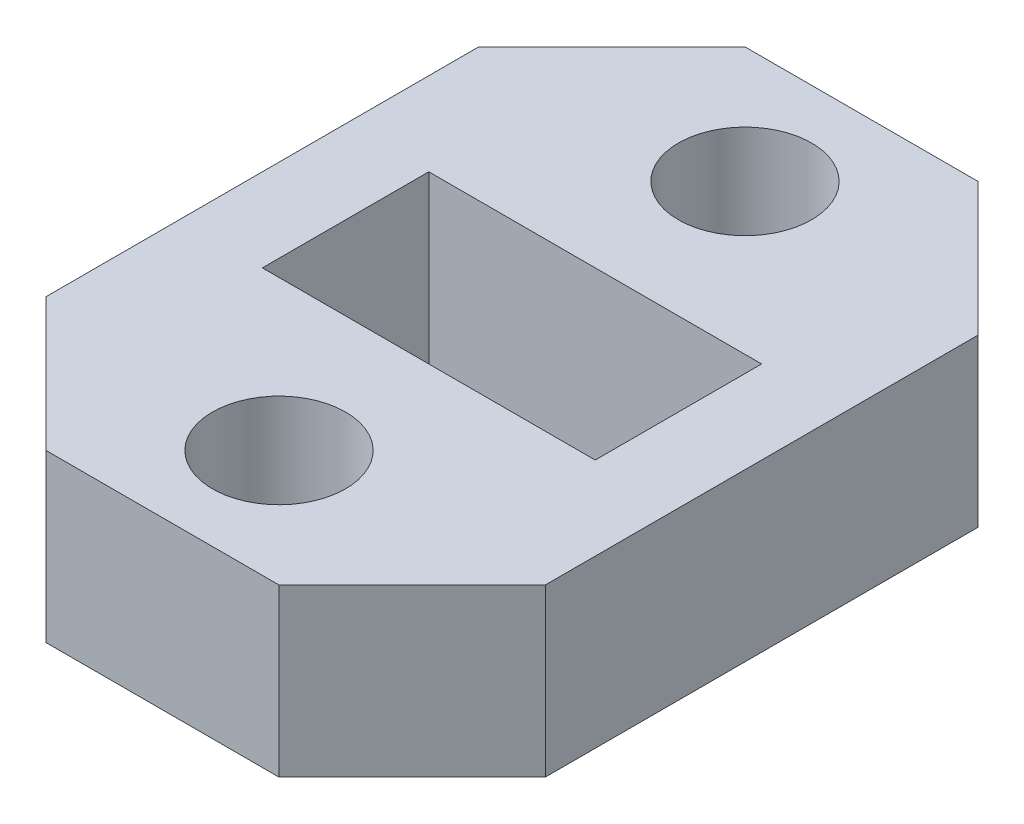
ISO-10303-21;
HEADER;
FILE_DESCRIPTION(('STEP AP214'),'2;1');
FILE_NAME('part.step','',(''),(''),'','','');
FILE_SCHEMA(('AUTOMOTIVE_DESIGN { 1 0 10303 214 1 1 1 1 }'));
ENDSEC;
DATA;
#1=APPLICATION_CONTEXT('core data for automotive mechanical design processes');
#2=APPLICATION_PROTOCOL_DEFINITION('international standard','automotive_design',2000,#1);
#3=PRODUCT_CONTEXT('',#1,'mechanical');
#4=PRODUCT('Part','Part','',(#3));
#5=PRODUCT_RELATED_PRODUCT_CATEGORY('part','',(#4));
#6=PRODUCT_DEFINITION_FORMATION('','',#4);
#7=PRODUCT_DEFINITION_CONTEXT('part definition',#1,'design');
#8=PRODUCT_DEFINITION('design','',#6,#7);
#9=PRODUCT_DEFINITION_SHAPE('','',#8);
#10=(LENGTH_UNIT() NAMED_UNIT(*) SI_UNIT(.MILLI.,.METRE.));
#11=(NAMED_UNIT(*) PLANE_ANGLE_UNIT() SI_UNIT($,.RADIAN.));
#12=(NAMED_UNIT(*) SI_UNIT($,.STERADIAN.) SOLID_ANGLE_UNIT());
#13=UNCERTAINTY_MEASURE_WITH_UNIT(LENGTH_MEASURE(1.E-05),#10,'distance_accuracy_value','');
#14=(GEOMETRIC_REPRESENTATION_CONTEXT(3) GLOBAL_UNCERTAINTY_ASSIGNED_CONTEXT((#13)) GLOBAL_UNIT_ASSIGNED_CONTEXT((#10,
#11,#12)) REPRESENTATION_CONTEXT('',''));
#15=CARTESIAN_POINT('',(0.,0.,0.));
#16=DIRECTION('',(0.,0.,1.));
#17=DIRECTION('',(1.,0.,0.));
#18=AXIS2_PLACEMENT_3D('',#15,#16,#17);
#19=CARTESIAN_POINT('',(7.5,5.,10.5));
#20=DIRECTION('',(-1.,0.,0.));
#21=DIRECTION('',(0.,0.,1.));
#22=AXIS2_PLACEMENT_3D('',#19,#20,#21);
#23=PLANE('',#22);
#24=DIRECTION('',(0.,0.,-1.));
#25=VECTOR('',#24,1.);
#26=CARTESIAN_POINT('',(7.5,5.,10.5));
#27=LINE('',#26,#25);
#28=CARTESIAN_POINT('',(7.5,5.,6.5));
#29=VERTEX_POINT('',#28);
#30=CARTESIAN_POINT('',(7.5,5.,-6.49999999999998));
#31=VERTEX_POINT('',#30);
#32=EDGE_CURVE('E172',#29,#31,#27,.T.);
#33=ORIENTED_EDGE('',*,*,#32,.F.);
#34=DIRECTION('',(0.,-1.,0.));
#35=VECTOR('',#34,1.);
#36=CARTESIAN_POINT('',(7.5,5.,6.5));
#37=LINE('',#36,#35);
#38=CARTESIAN_POINT('',(7.5,0.,6.5));
#39=VERTEX_POINT('',#38);
#40=EDGE_CURVE('E219',#29,#39,#37,.T.);
#41=ORIENTED_EDGE('',*,*,#40,.T.);
#42=DIRECTION('',(0.,0.,-1.));
#43=VECTOR('',#42,1.);
#44=CARTESIAN_POINT('',(7.5,0.,10.5));
#45=LINE('',#44,#43);
#46=CARTESIAN_POINT('',(7.5,0.,-6.49999999999998));
#47=VERTEX_POINT('',#46);
#48=EDGE_CURVE('E168',#39,#47,#45,.T.);
#49=ORIENTED_EDGE('',*,*,#48,.T.);
#50=DIRECTION('',(0.,1.,0.));
#51=VECTOR('',#50,1.);
#52=CARTESIAN_POINT('',(7.5,5.,-6.49999999999999));
#53=LINE('',#52,#51);
#54=EDGE_CURVE('E217',#47,#31,#53,.T.);
#55=ORIENTED_EDGE('',*,*,#54,.T.);
#56=EDGE_LOOP('',(#33,#41,#49,#55));
#57=FACE_BOUND('',#56,.T.);
#58=ADVANCED_FACE('F34',(#57),#23,.F.);
#59=CARTESIAN_POINT('',(-7.5,5.,-10.5));
#60=DIRECTION('',(0.,0.,1.));
#61=DIRECTION('',(1.,0.,0.));
#62=AXIS2_PLACEMENT_3D('',#59,#60,#61);
#63=PLANE('',#62);
#64=DIRECTION('',(-1.,0.,0.));
#65=VECTOR('',#64,1.);
#66=CARTESIAN_POINT('',(-7.5,5.,-10.5));
#67=LINE('',#66,#65);
#68=CARTESIAN_POINT('',(3.5,5.,-10.5));
#69=VERTEX_POINT('',#68);
#70=CARTESIAN_POINT('',(-3.49999999999999,5.,-10.5));
#71=VERTEX_POINT('',#70);
#72=EDGE_CURVE('E174',#69,#71,#67,.T.);
#73=ORIENTED_EDGE('',*,*,#72,.F.);
#74=DIRECTION('',(0.,-1.,0.));
#75=VECTOR('',#74,1.);
#76=CARTESIAN_POINT('',(3.5,5.,-10.5));
#77=LINE('',#76,#75);
#78=CARTESIAN_POINT('',(3.5,0.,-10.5));
#79=VERTEX_POINT('',#78);
#80=EDGE_CURVE('E11',#69,#79,#77,.T.);
#81=ORIENTED_EDGE('',*,*,#80,.T.);
#82=DIRECTION('',(-1.,0.,0.));
#83=VECTOR('',#82,1.);
#84=CARTESIAN_POINT('',(-7.5,0.,-10.5));
#85=LINE('',#84,#83);
#86=CARTESIAN_POINT('',(-3.49999999999999,0.,-10.5));
#87=VERTEX_POINT('',#86);
#88=EDGE_CURVE('E186',#79,#87,#85,.T.);
#89=ORIENTED_EDGE('',*,*,#88,.T.);
#90=DIRECTION('',(0.,1.,0.));
#91=VECTOR('',#90,1.);
#92=CARTESIAN_POINT('',(-3.49999999999999,5.,-10.5));
#93=LINE('',#92,#91);
#94=EDGE_CURVE('E42',#87,#71,#93,.T.);
#95=ORIENTED_EDGE('',*,*,#94,.T.);
#96=EDGE_LOOP('',(#73,#81,#89,#95));
#97=FACE_BOUND('',#96,.T.);
#98=ADVANCED_FACE('F233',(#97),#63,.F.);
#99=CARTESIAN_POINT('',(-7.5,5.,10.5));
#100=DIRECTION('',(1.,0.,0.));
#101=DIRECTION('',(0.,0.,-1.));
#102=AXIS2_PLACEMENT_3D('',#99,#100,#101);
#103=PLANE('',#102);
#104=DIRECTION('',(0.,0.,1.));
#105=VECTOR('',#104,1.);
#106=CARTESIAN_POINT('',(-7.5,0.,10.5));
#107=LINE('',#106,#105);
#108=CARTESIAN_POINT('',(-7.5,0.,-6.49999999999999));
#109=VERTEX_POINT('',#108);
#110=CARTESIAN_POINT('',(-7.5,0.,6.49999999999999));
#111=VERTEX_POINT('',#110);
#112=EDGE_CURVE('E188',#109,#111,#107,.T.);
#113=ORIENTED_EDGE('',*,*,#112,.T.);
#114=DIRECTION('',(0.,1.,0.));
#115=VECTOR('',#114,1.);
#116=CARTESIAN_POINT('',(-7.5,5.,6.49999999999999));
#117=LINE('',#116,#115);
#118=CARTESIAN_POINT('',(-7.5,5.,6.49999999999999));
#119=VERTEX_POINT('',#118);
#120=EDGE_CURVE('E208',#111,#119,#117,.T.);
#121=ORIENTED_EDGE('',*,*,#120,.T.);
#122=DIRECTION('',(0.,0.,1.));
#123=VECTOR('',#122,1.);
#124=CARTESIAN_POINT('',(-7.5,5.,10.5));
#125=LINE('',#124,#123);
#126=CARTESIAN_POINT('',(-7.5,5.,-6.49999999999999));
#127=VERTEX_POINT('',#126);
#128=EDGE_CURVE('E177',#127,#119,#125,.T.);
#129=ORIENTED_EDGE('',*,*,#128,.F.);
#130=DIRECTION('',(0.,-1.,0.));
#131=VECTOR('',#130,1.);
#132=CARTESIAN_POINT('',(-7.5,5.,-6.5));
#133=LINE('',#132,#131);
#134=EDGE_CURVE('E205',#127,#109,#133,.T.);
#135=ORIENTED_EDGE('',*,*,#134,.T.);
#136=EDGE_LOOP('',(#113,#121,#129,#135));
#137=FACE_BOUND('',#136,.T.);
#138=ADVANCED_FACE('F241',(#137),#103,.F.);
#139=CARTESIAN_POINT('',(-7.5,5.,10.5));
#140=DIRECTION('',(0.,0.,-1.));
#141=DIRECTION('',(-1.,0.,0.));
#142=AXIS2_PLACEMENT_3D('',#139,#140,#141);
#143=PLANE('',#142);
#144=DIRECTION('',(1.,0.,0.));
#145=VECTOR('',#144,1.);
#146=CARTESIAN_POINT('',(-7.5,5.,10.5));
#147=LINE('',#146,#145);
#148=CARTESIAN_POINT('',(-3.5,5.,10.5));
#149=VERTEX_POINT('',#148);
#150=CARTESIAN_POINT('',(3.49999999999999,5.,10.5));
#151=VERTEX_POINT('',#150);
#152=EDGE_CURVE('E180',#149,#151,#147,.T.);
#153=ORIENTED_EDGE('',*,*,#152,.F.);
#154=DIRECTION('',(0.,-1.,0.));
#155=VECTOR('',#154,1.);
#156=CARTESIAN_POINT('',(-3.5,5.,10.5));
#157=LINE('',#156,#155);
#158=CARTESIAN_POINT('',(-3.5,0.,10.5));
#159=VERTEX_POINT('',#158);
#160=EDGE_CURVE('E194',#149,#159,#157,.T.);
#161=ORIENTED_EDGE('',*,*,#160,.T.);
#162=DIRECTION('',(1.,0.,0.));
#163=VECTOR('',#162,1.);
#164=CARTESIAN_POINT('',(-7.5,0.,10.5));
#165=LINE('',#164,#163);
#166=CARTESIAN_POINT('',(3.49999999999999,0.,10.5));
#167=VERTEX_POINT('',#166);
#168=EDGE_CURVE('E175',#159,#167,#165,.T.);
#169=ORIENTED_EDGE('',*,*,#168,.T.);
#170=DIRECTION('',(0.,1.,0.));
#171=VECTOR('',#170,1.);
#172=CARTESIAN_POINT('',(3.49999999999999,5.,10.5));
#173=LINE('',#172,#171);
#174=EDGE_CURVE('E183',#167,#151,#173,.T.);
#175=ORIENTED_EDGE('',*,*,#174,.T.);
#176=EDGE_LOOP('',(#153,#161,#169,#175));
#177=FACE_BOUND('',#176,.T.);
#178=ADVANCED_FACE('F249',(#177),#143,.F.);
#179=CARTESIAN_POINT('',(0.,5.,0.));
#180=DIRECTION('',(0.,-1.,0.));
#181=DIRECTION('',(0.,0.,-1.));
#182=AXIS2_PLACEMENT_3D('',#179,#180,#181);
#183=PLANE('',#182);
#184=CARTESIAN_POINT('',(0.,5.,7.));
#185=DIRECTION('',(0.,1.,0.));
#186=DIRECTION('',(0.,0.,-1.));
#187=AXIS2_PLACEMENT_3D('',#184,#185,#186);
#188=CIRCLE('',#187,2.);
#189=CARTESIAN_POINT('',(0.,5.,5.));
#190=VERTEX_POINT('',#189);
#191=EDGE_CURVE('E155',#190,#190,#188,.T.);
#192=ORIENTED_EDGE('',*,*,#191,.F.);
#193=EDGE_LOOP('',(#192));
#194=FACE_BOUND('',#193,.T.);
#195=CARTESIAN_POINT('',(0.,5.,-7.));
#196=DIRECTION('',(0.,1.,0.));
#197=DIRECTION('',(0.,0.,1.));
#198=AXIS2_PLACEMENT_3D('',#195,#196,#197);
#199=CIRCLE('',#198,2.);
#200=CARTESIAN_POINT('',(0.,5.,-5.));
#201=VERTEX_POINT('',#200);
#202=EDGE_CURVE('E302',#201,#201,#199,.T.);
#203=ORIENTED_EDGE('',*,*,#202,.F.);
#204=EDGE_LOOP('',(#203));
#205=FACE_BOUND('',#204,.T.);
#206=DIRECTION('',(-1.,0.,0.));
#207=VECTOR('',#206,1.);
#208=CARTESIAN_POINT('',(-5.,5.,-2.5));
#209=LINE('',#208,#207);
#210=CARTESIAN_POINT('',(5.,5.,-2.5));
#211=VERTEX_POINT('',#210);
#212=CARTESIAN_POINT('',(-5.,5.,-2.5));
#213=VERTEX_POINT('',#212);
#214=EDGE_CURVE('E161',#211,#213,#209,.T.);
#215=ORIENTED_EDGE('',*,*,#214,.F.);
#216=DIRECTION('',(0.,0.,-1.));
#217=VECTOR('',#216,1.);
#218=CARTESIAN_POINT('',(5.,5.,2.5));
#219=LINE('',#218,#217);
#220=CARTESIAN_POINT('',(5.,5.,2.5));
#221=VERTEX_POINT('',#220);
#222=EDGE_CURVE('E131',#221,#211,#219,.T.);
#223=ORIENTED_EDGE('',*,*,#222,.F.);
#224=DIRECTION('',(1.,0.,0.));
#225=VECTOR('',#224,1.);
#226=CARTESIAN_POINT('',(-5.,5.,2.5));
#227=LINE('',#226,#225);
#228=CARTESIAN_POINT('',(-5.,5.,2.5));
#229=VERTEX_POINT('',#228);
#230=EDGE_CURVE('E149',#229,#221,#227,.T.);
#231=ORIENTED_EDGE('',*,*,#230,.F.);
#232=DIRECTION('',(0.,0.,1.));
#233=VECTOR('',#232,1.);
#234=CARTESIAN_POINT('',(-5.,5.,2.5));
#235=LINE('',#234,#233);
#236=EDGE_CURVE('E152',#213,#229,#235,.T.);
#237=ORIENTED_EDGE('',*,*,#236,.F.);
#238=EDGE_LOOP('',(#215,#223,#231,#237));
#239=FACE_BOUND('',#238,.T.);
#240=ORIENTED_EDGE('',*,*,#128,.T.);
#241=DIRECTION('',(-0.707106781186547,0.,-0.707106781186548));
#242=VECTOR('',#241,1.);
#243=CARTESIAN_POINT('',(-3.5,5.,10.5));
#244=LINE('',#243,#242);
#245=EDGE_CURVE('E215',#119,#149,#244,.F.);
#246=ORIENTED_EDGE('',*,*,#245,.T.);
#247=ORIENTED_EDGE('',*,*,#152,.T.);
#248=DIRECTION('',(-0.707106781186548,0.,0.707106781186547));
#249=VECTOR('',#248,1.);
#250=CARTESIAN_POINT('',(7.5,5.,6.5));
#251=LINE('',#250,#249);
#252=EDGE_CURVE('E213',#151,#29,#251,.F.);
#253=ORIENTED_EDGE('',*,*,#252,.T.);
#254=ORIENTED_EDGE('',*,*,#32,.T.);
#255=DIRECTION('',(0.707106781186547,0.,0.707106781186548));
#256=VECTOR('',#255,1.);
#257=CARTESIAN_POINT('',(3.5,5.,-10.5));
#258=LINE('',#257,#256);
#259=EDGE_CURVE('E55',#31,#69,#258,.F.);
#260=ORIENTED_EDGE('',*,*,#259,.T.);
#261=ORIENTED_EDGE('',*,*,#72,.T.);
#262=DIRECTION('',(0.707106781186548,0.,-0.707106781186547));
#263=VECTOR('',#262,1.);
#264=CARTESIAN_POINT('',(-7.5,5.,-6.5));
#265=LINE('',#264,#263);
#266=EDGE_CURVE('E210',#71,#127,#265,.F.);
#267=ORIENTED_EDGE('',*,*,#266,.T.);
#268=EDGE_LOOP('',(#240,#246,#247,#253,#254,#260,#261,#267));
#269=FACE_BOUND('',#268,.T.);
#270=ADVANCED_FACE('F235',(#194,#205,#239,#269),#183,.F.);
#271=CARTESIAN_POINT('',(0.,0.,0.));
#272=DIRECTION('',(0.,-1.,0.));
#273=DIRECTION('',(0.,0.,-1.));
#274=AXIS2_PLACEMENT_3D('',#271,#272,#273);
#275=PLANE('',#274);
#276=CARTESIAN_POINT('',(0.,0.,7.));
#277=DIRECTION('',(0.,1.,0.));
#278=DIRECTION('',(0.,0.,-1.));
#279=AXIS2_PLACEMENT_3D('',#276,#277,#278);
#280=CIRCLE('',#279,2.);
#281=CARTESIAN_POINT('',(0.,0.,5.));
#282=VERTEX_POINT('',#281);
#283=EDGE_CURVE('E304',#282,#282,#280,.T.);
#284=ORIENTED_EDGE('',*,*,#283,.T.);
#285=EDGE_LOOP('',(#284));
#286=FACE_BOUND('',#285,.T.);
#287=CARTESIAN_POINT('',(0.,0.,-7.));
#288=DIRECTION('',(0.,1.,0.));
#289=DIRECTION('',(0.,0.,1.));
#290=AXIS2_PLACEMENT_3D('',#287,#288,#289);
#291=CIRCLE('',#290,2.);
#292=CARTESIAN_POINT('',(0.,0.,-5.));
#293=VERTEX_POINT('',#292);
#294=EDGE_CURVE('E162',#293,#293,#291,.T.);
#295=ORIENTED_EDGE('',*,*,#294,.T.);
#296=EDGE_LOOP('',(#295));
#297=FACE_BOUND('',#296,.T.);
#298=DIRECTION('',(0.,0.,-1.));
#299=VECTOR('',#298,1.);
#300=CARTESIAN_POINT('',(5.,0.,2.5));
#301=LINE('',#300,#299);
#302=CARTESIAN_POINT('',(5.,0.,2.5));
#303=VERTEX_POINT('',#302);
#304=CARTESIAN_POINT('',(5.,0.,-2.5));
#305=VERTEX_POINT('',#304);
#306=EDGE_CURVE('E128',#303,#305,#301,.T.);
#307=ORIENTED_EDGE('',*,*,#306,.T.);
#308=DIRECTION('',(-1.,0.,0.));
#309=VECTOR('',#308,1.);
#310=CARTESIAN_POINT('',(-5.,0.,-2.5));
#311=LINE('',#310,#309);
#312=CARTESIAN_POINT('',(-5.,0.,-2.5));
#313=VERTEX_POINT('',#312);
#314=EDGE_CURVE('E140',#305,#313,#311,.T.);
#315=ORIENTED_EDGE('',*,*,#314,.T.);
#316=DIRECTION('',(0.,0.,1.));
#317=VECTOR('',#316,1.);
#318=CARTESIAN_POINT('',(-5.,0.,2.5));
#319=LINE('',#318,#317);
#320=CARTESIAN_POINT('',(-5.,0.,2.5));
#321=VERTEX_POINT('',#320);
#322=EDGE_CURVE('E144',#313,#321,#319,.T.);
#323=ORIENTED_EDGE('',*,*,#322,.T.);
#324=DIRECTION('',(1.,0.,0.));
#325=VECTOR('',#324,1.);
#326=CARTESIAN_POINT('',(-5.,0.,2.5));
#327=LINE('',#326,#325);
#328=EDGE_CURVE('E136',#321,#303,#327,.T.);
#329=ORIENTED_EDGE('',*,*,#328,.T.);
#330=EDGE_LOOP('',(#307,#315,#323,#329));
#331=FACE_BOUND('',#330,.T.);
#332=ORIENTED_EDGE('',*,*,#168,.F.);
#333=DIRECTION('',(0.707106781186547,0.,0.707106781186548));
#334=VECTOR('',#333,1.);
#335=CARTESIAN_POINT('',(-7.00000000000001,0.,6.99999999999999));
#336=LINE('',#335,#334);
#337=EDGE_CURVE('E203',#159,#111,#336,.F.);
#338=ORIENTED_EDGE('',*,*,#337,.T.);
#339=ORIENTED_EDGE('',*,*,#112,.F.);
#340=DIRECTION('',(-0.707106781186548,0.,0.707106781186547));
#341=VECTOR('',#340,1.);
#342=CARTESIAN_POINT('',(-6.99999999999999,0.,-7.00000000000001));
#343=LINE('',#342,#341);
#344=EDGE_CURVE('E197',#109,#87,#343,.F.);
#345=ORIENTED_EDGE('',*,*,#344,.T.);
#346=ORIENTED_EDGE('',*,*,#88,.F.);
#347=DIRECTION('',(-0.707106781186547,0.,-0.707106781186548));
#348=VECTOR('',#347,1.);
#349=CARTESIAN_POINT('',(7.,0.,-6.99999999999999));
#350=LINE('',#349,#348);
#351=EDGE_CURVE('E199',#79,#47,#350,.F.);
#352=ORIENTED_EDGE('',*,*,#351,.T.);
#353=ORIENTED_EDGE('',*,*,#48,.F.);
#354=DIRECTION('',(0.707106781186548,0.,-0.707106781186547));
#355=VECTOR('',#354,1.);
#356=CARTESIAN_POINT('',(6.99999999999999,0.,7.00000000000001));
#357=LINE('',#356,#355);
#358=EDGE_CURVE('E201',#39,#167,#357,.F.);
#359=ORIENTED_EDGE('',*,*,#358,.T.);
#360=EDGE_LOOP('',(#332,#338,#339,#345,#346,#352,#353,#359));
#361=FACE_BOUND('',#360,.T.);
#362=ADVANCED_FACE('F146',(#286,#297,#331,#361),#275,.T.);
#363=CARTESIAN_POINT('',(5.,0.,2.5));
#364=DIRECTION('',(1.,0.,0.));
#365=DIRECTION('',(0.,0.,-1.));
#366=AXIS2_PLACEMENT_3D('',#363,#364,#365);
#367=PLANE('',#366);
#368=ORIENTED_EDGE('',*,*,#222,.T.);
#369=DIRECTION('',(0.,1.,0.));
#370=VECTOR('',#369,1.);
#371=CARTESIAN_POINT('',(5.,0.,-2.5));
#372=LINE('',#371,#370);
#373=EDGE_CURVE('E124',#305,#211,#372,.T.);
#374=ORIENTED_EDGE('',*,*,#373,.F.);
#375=ORIENTED_EDGE('',*,*,#306,.F.);
#376=DIRECTION('',(0.,1.,0.));
#377=VECTOR('',#376,1.);
#378=CARTESIAN_POINT('',(5.,0.,2.5));
#379=LINE('',#378,#377);
#380=EDGE_CURVE('E166',#303,#221,#379,.T.);
#381=ORIENTED_EDGE('',*,*,#380,.T.);
#382=EDGE_LOOP('',(#368,#374,#375,#381));
#383=FACE_BOUND('',#382,.T.);
#384=ADVANCED_FACE('F126',(#383),#367,.F.);
#385=CARTESIAN_POINT('',(-5.,0.,2.5));
#386=DIRECTION('',(0.,0.,1.));
#387=DIRECTION('',(1.,0.,0.));
#388=AXIS2_PLACEMENT_3D('',#385,#386,#387);
#389=PLANE('',#388);
#390=ORIENTED_EDGE('',*,*,#230,.T.);
#391=ORIENTED_EDGE('',*,*,#380,.F.);
#392=ORIENTED_EDGE('',*,*,#328,.F.);
#393=DIRECTION('',(0.,1.,0.));
#394=VECTOR('',#393,1.);
#395=CARTESIAN_POINT('',(-5.,0.,2.5));
#396=LINE('',#395,#394);
#397=EDGE_CURVE('E169',#321,#229,#396,.T.);
#398=ORIENTED_EDGE('',*,*,#397,.T.);
#399=EDGE_LOOP('',(#390,#391,#392,#398));
#400=FACE_BOUND('',#399,.T.);
#401=ADVANCED_FACE('F279',(#400),#389,.F.);
#402=CARTESIAN_POINT('',(-5.,0.,2.5));
#403=DIRECTION('',(-1.,0.,0.));
#404=DIRECTION('',(0.,0.,1.));
#405=AXIS2_PLACEMENT_3D('',#402,#403,#404);
#406=PLANE('',#405);
#407=ORIENTED_EDGE('',*,*,#236,.T.);
#408=ORIENTED_EDGE('',*,*,#397,.F.);
#409=ORIENTED_EDGE('',*,*,#322,.F.);
#410=DIRECTION('',(0.,1.,0.));
#411=VECTOR('',#410,1.);
#412=CARTESIAN_POINT('',(-5.,0.,-2.5));
#413=LINE('',#412,#411);
#414=EDGE_CURVE('E135',#313,#213,#413,.T.);
#415=ORIENTED_EDGE('',*,*,#414,.T.);
#416=EDGE_LOOP('',(#407,#408,#409,#415));
#417=FACE_BOUND('',#416,.T.);
#418=ADVANCED_FACE('F283',(#417),#406,.F.);
#419=CARTESIAN_POINT('',(-5.,0.,-2.5));
#420=DIRECTION('',(0.,0.,-1.));
#421=DIRECTION('',(-1.,0.,0.));
#422=AXIS2_PLACEMENT_3D('',#419,#420,#421);
#423=PLANE('',#422);
#424=ORIENTED_EDGE('',*,*,#214,.T.);
#425=ORIENTED_EDGE('',*,*,#414,.F.);
#426=ORIENTED_EDGE('',*,*,#314,.F.);
#427=ORIENTED_EDGE('',*,*,#373,.T.);
#428=EDGE_LOOP('',(#424,#425,#426,#427));
#429=FACE_BOUND('',#428,.T.);
#430=ADVANCED_FACE('F141',(#429),#423,.F.);
#431=CARTESIAN_POINT('',(0.,0.,-7.));
#432=DIRECTION('',(0.,1.,0.));
#433=DIRECTION('',(0.,0.,1.));
#434=AXIS2_PLACEMENT_3D('',#431,#432,#433);
#435=CYLINDRICAL_SURFACE('',#434,2.);
#436=ORIENTED_EDGE('',*,*,#294,.F.);
#437=EDGE_LOOP('',(#436));
#438=FACE_BOUND('',#437,.T.);
#439=ORIENTED_EDGE('',*,*,#202,.T.);
#440=EDGE_LOOP('',(#439));
#441=FACE_BOUND('',#440,.T.);
#442=ADVANCED_FACE('F282',(#438,#441),#435,.F.);
#443=CARTESIAN_POINT('',(0.,0.,7.));
#444=DIRECTION('',(0.,1.,0.));
#445=DIRECTION('',(0.,0.,1.));
#446=AXIS2_PLACEMENT_3D('',#443,#444,#445);
#447=CYLINDRICAL_SURFACE('',#446,2.);
#448=ORIENTED_EDGE('',*,*,#283,.F.);
#449=EDGE_LOOP('',(#448));
#450=FACE_BOUND('',#449,.T.);
#451=ORIENTED_EDGE('',*,*,#191,.T.);
#452=EDGE_LOOP('',(#451));
#453=FACE_BOUND('',#452,.T.);
#454=ADVANCED_FACE('F258',(#450,#453),#447,.F.);
#455=CARTESIAN_POINT('',(-3.5,5.,10.5));
#456=DIRECTION('',(0.707106781186548,0.,-0.707106781186547));
#457=DIRECTION('',(0.,-1.,0.));
#458=AXIS2_PLACEMENT_3D('',#455,#456,#457);
#459=PLANE('',#458);
#460=ORIENTED_EDGE('',*,*,#245,.F.);
#461=ORIENTED_EDGE('',*,*,#120,.F.);
#462=ORIENTED_EDGE('',*,*,#337,.F.);
#463=ORIENTED_EDGE('',*,*,#160,.F.);
#464=EDGE_LOOP('',(#460,#461,#462,#463));
#465=FACE_BOUND('',#464,.T.);
#466=ADVANCED_FACE('F246',(#465),#459,.F.);
#467=CARTESIAN_POINT('',(7.5,5.,6.5));
#468=DIRECTION('',(-0.707106781186547,0.,-0.707106781186548));
#469=DIRECTION('',(0.,-1.,0.));
#470=AXIS2_PLACEMENT_3D('',#467,#468,#469);
#471=PLANE('',#470);
#472=ORIENTED_EDGE('',*,*,#252,.F.);
#473=ORIENTED_EDGE('',*,*,#174,.F.);
#474=ORIENTED_EDGE('',*,*,#358,.F.);
#475=ORIENTED_EDGE('',*,*,#40,.F.);
#476=EDGE_LOOP('',(#472,#473,#474,#475));
#477=FACE_BOUND('',#476,.T.);
#478=ADVANCED_FACE('F251',(#477),#471,.F.);
#479=CARTESIAN_POINT('',(3.5,5.,-10.5));
#480=DIRECTION('',(-0.707106781186548,0.,0.707106781186547));
#481=DIRECTION('',(0.,-1.,0.));
#482=AXIS2_PLACEMENT_3D('',#479,#480,#481);
#483=PLANE('',#482);
#484=ORIENTED_EDGE('',*,*,#259,.F.);
#485=ORIENTED_EDGE('',*,*,#54,.F.);
#486=ORIENTED_EDGE('',*,*,#351,.F.);
#487=ORIENTED_EDGE('',*,*,#80,.F.);
#488=EDGE_LOOP('',(#484,#485,#486,#487));
#489=FACE_BOUND('',#488,.T.);
#490=ADVANCED_FACE('F232',(#489),#483,.F.);
#491=CARTESIAN_POINT('',(-7.5,5.,-6.5));
#492=DIRECTION('',(0.707106781186547,0.,0.707106781186548));
#493=DIRECTION('',(0.,-1.,0.));
#494=AXIS2_PLACEMENT_3D('',#491,#492,#493);
#495=PLANE('',#494);
#496=ORIENTED_EDGE('',*,*,#266,.F.);
#497=ORIENTED_EDGE('',*,*,#94,.F.);
#498=ORIENTED_EDGE('',*,*,#344,.F.);
#499=ORIENTED_EDGE('',*,*,#134,.F.);
#500=EDGE_LOOP('',(#496,#497,#498,#499));
#501=FACE_BOUND('',#500,.T.);
#502=ADVANCED_FACE('F36',(#501),#495,.F.);
#503=CLOSED_SHELL('',(#58,#98,#138,#178,#270,#362,#384,#401,#418,#430,#442,#454,#466,#478,#490,#502));
#504=MANIFOLD_SOLID_BREP('B2',#503);
#505=ADVANCED_BREP_SHAPE_REPRESENTATION('',(#18,#504),#14);
#506=SHAPE_DEFINITION_REPRESENTATION(#9,#505);
ENDSEC;
END-ISO-10303-21;
